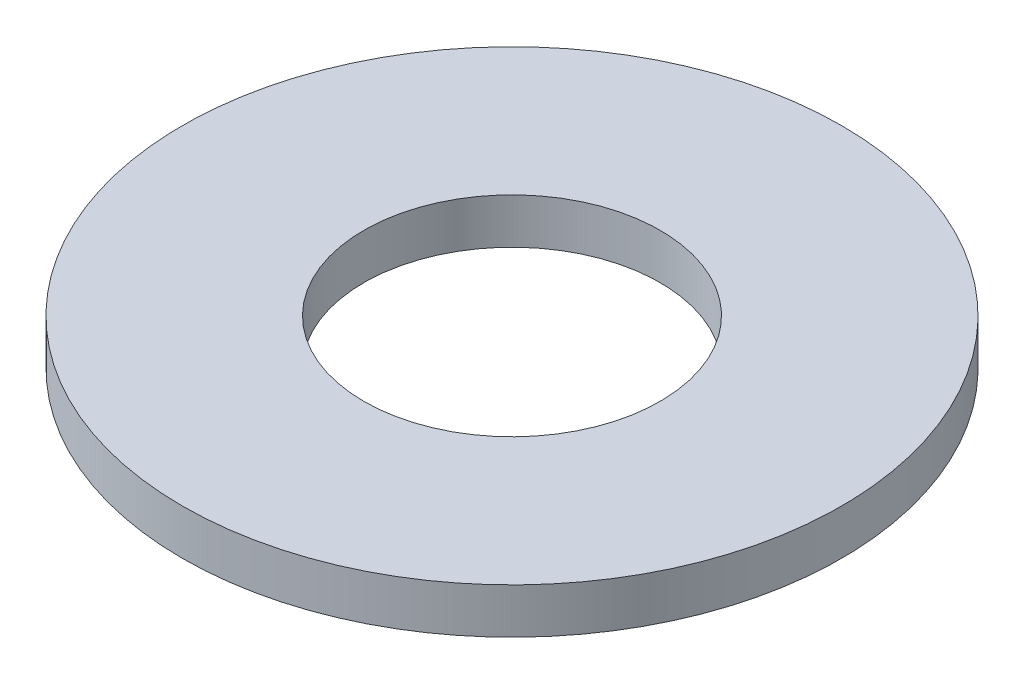
ISO-10303-21;
HEADER;
FILE_DESCRIPTION(('STEP AP214'),'2;1');
FILE_NAME('part.step','',(''),(''),'','','');
FILE_SCHEMA(('AUTOMOTIVE_DESIGN { 1 0 10303 214 1 1 1 1 }'));
ENDSEC;
DATA;
#1=APPLICATION_CONTEXT('core data for automotive mechanical design processes');
#2=APPLICATION_PROTOCOL_DEFINITION('international standard','automotive_design',2000,#1);
#3=PRODUCT_CONTEXT('',#1,'mechanical');
#4=PRODUCT('Part','Part','',(#3));
#5=PRODUCT_RELATED_PRODUCT_CATEGORY('part','',(#4));
#6=PRODUCT_DEFINITION_FORMATION('','',#4);
#7=PRODUCT_DEFINITION_CONTEXT('part definition',#1,'design');
#8=PRODUCT_DEFINITION('design','',#6,#7);
#9=PRODUCT_DEFINITION_SHAPE('','',#8);
#10=(LENGTH_UNIT() NAMED_UNIT(*) SI_UNIT(.MILLI.,.METRE.));
#11=(NAMED_UNIT(*) PLANE_ANGLE_UNIT() SI_UNIT($,.RADIAN.));
#12=(NAMED_UNIT(*) SI_UNIT($,.STERADIAN.) SOLID_ANGLE_UNIT());
#13=UNCERTAINTY_MEASURE_WITH_UNIT(LENGTH_MEASURE(1.E-05),#10,'distance_accuracy_value','');
#14=(GEOMETRIC_REPRESENTATION_CONTEXT(3) GLOBAL_UNCERTAINTY_ASSIGNED_CONTEXT((#13)) GLOBAL_UNIT_ASSIGNED_CONTEXT((#10,
#11,#12)) REPRESENTATION_CONTEXT('',''));
#15=CARTESIAN_POINT('',(0.,0.,0.));
#16=DIRECTION('',(0.,0.,1.));
#17=DIRECTION('',(1.,0.,0.));
#18=AXIS2_PLACEMENT_3D('',#15,#16,#17);
#19=CARTESIAN_POINT('',(-34.8896243531353,0.791848186143973,35.1899273553411));
#20=DIRECTION('',(0.,-1.,0.));
#21=DIRECTION('',(0.,0.,-1.));
#22=AXIS2_PLACEMENT_3D('',#19,#20,#21);
#23=CYLINDRICAL_SURFACE('',#22,7.9375);
#24=CARTESIAN_POINT('',(-34.8896243531353,0.791848186143973,35.1899273553411));
#25=DIRECTION('',(0.,1.,0.));
#26=DIRECTION('',(0.,0.,1.));
#27=AXIS2_PLACEMENT_3D('',#24,#25,#26);
#28=CIRCLE('',#27,7.9375);
#29=CARTESIAN_POINT('',(-34.8896243531353,0.791848186143973,43.1274273553411));
#30=VERTEX_POINT('',#29);
#31=EDGE_CURVE('E10',#30,#30,#28,.T.);
#32=ORIENTED_EDGE('',*,*,#31,.F.);
#33=EDGE_LOOP('',(#32));
#34=FACE_BOUND('',#33,.T.);
#35=CARTESIAN_POINT('',(-34.8896243531353,-0.300351813856015,35.1899273553411));
#36=DIRECTION('',(0.,1.,0.));
#37=DIRECTION('',(0.,0.,1.));
#38=AXIS2_PLACEMENT_3D('',#35,#36,#37);
#39=CIRCLE('',#38,7.9375);
#40=CARTESIAN_POINT('',(-34.8896243531353,-0.300351813856015,43.1274273553411));
#41=VERTEX_POINT('',#40);
#42=EDGE_CURVE('E38',#41,#41,#39,.T.);
#43=ORIENTED_EDGE('',*,*,#42,.T.);
#44=EDGE_LOOP('',(#43));
#45=FACE_BOUND('',#44,.T.);
#46=ADVANCED_FACE('F35',(#34,#45),#23,.T.);
#47=CARTESIAN_POINT('',(-34.8896243531353,0.791848186143973,35.1899273553411));
#48=DIRECTION('',(0.,1.,0.));
#49=DIRECTION('',(0.,0.,1.));
#50=AXIS2_PLACEMENT_3D('',#47,#48,#49);
#51=PLANE('',#50);
#52=CARTESIAN_POINT('',(-34.8896243531353,0.791848186143973,35.1899273553411));
#53=DIRECTION('',(0.,1.,0.));
#54=DIRECTION('',(0.,0.,1.));
#55=AXIS2_PLACEMENT_3D('',#52,#53,#54);
#56=CIRCLE('',#55,3.5687);
#57=CARTESIAN_POINT('',(-34.8896243531353,0.791848186143973,38.7586273553411));
#58=VERTEX_POINT('',#57);
#59=EDGE_CURVE('E47',#58,#58,#56,.T.);
#60=ORIENTED_EDGE('',*,*,#59,.F.);
#61=EDGE_LOOP('',(#60));
#62=FACE_BOUND('',#61,.T.);
#63=ORIENTED_EDGE('',*,*,#31,.T.);
#64=EDGE_LOOP('',(#63));
#65=FACE_BOUND('',#64,.T.);
#66=ADVANCED_FACE('F62',(#62,#65),#51,.T.);
#67=CARTESIAN_POINT('',(-34.8896243531353,-0.300351813856015,35.1899273553411));
#68=DIRECTION('',(0.,1.,0.));
#69=DIRECTION('',(0.,0.,1.));
#70=AXIS2_PLACEMENT_3D('',#67,#68,#69);
#71=PLANE('',#70);
#72=CARTESIAN_POINT('',(-34.8896243531353,-0.300351813856015,35.1899273553411));
#73=DIRECTION('',(0.,1.,0.));
#74=DIRECTION('',(0.,0.,1.));
#75=AXIS2_PLACEMENT_3D('',#72,#73,#74);
#76=CIRCLE('',#75,3.5687);
#77=CARTESIAN_POINT('',(-34.8896243531353,-0.300351813856015,38.7586273553411));
#78=VERTEX_POINT('',#77);
#79=EDGE_CURVE('E45',#78,#78,#76,.T.);
#80=ORIENTED_EDGE('',*,*,#79,.T.);
#81=EDGE_LOOP('',(#80));
#82=FACE_BOUND('',#81,.T.);
#83=ORIENTED_EDGE('',*,*,#42,.F.);
#84=EDGE_LOOP('',(#83));
#85=FACE_BOUND('',#84,.T.);
#86=ADVANCED_FACE('F53',(#82,#85),#71,.F.);
#87=CARTESIAN_POINT('',(-34.8896243531353,-0.300351813856015,35.1899273553411));
#88=DIRECTION('',(0.,1.,0.));
#89=DIRECTION('',(0.,0.,1.));
#90=AXIS2_PLACEMENT_3D('',#87,#88,#89);
#91=CYLINDRICAL_SURFACE('',#90,3.5687);
#92=ORIENTED_EDGE('',*,*,#79,.F.);
#93=EDGE_LOOP('',(#92));
#94=FACE_BOUND('',#93,.T.);
#95=ORIENTED_EDGE('',*,*,#59,.T.);
#96=EDGE_LOOP('',(#95));
#97=FACE_BOUND('',#96,.T.);
#98=ADVANCED_FACE('F56',(#94,#97),#91,.F.);
#99=CLOSED_SHELL('',(#46,#66,#86,#98));
#100=MANIFOLD_SOLID_BREP('B2',#99);
#101=ADVANCED_BREP_SHAPE_REPRESENTATION('',(#18,#100),#14);
#102=SHAPE_DEFINITION_REPRESENTATION(#9,#101);
ENDSEC;
END-ISO-10303-21;
